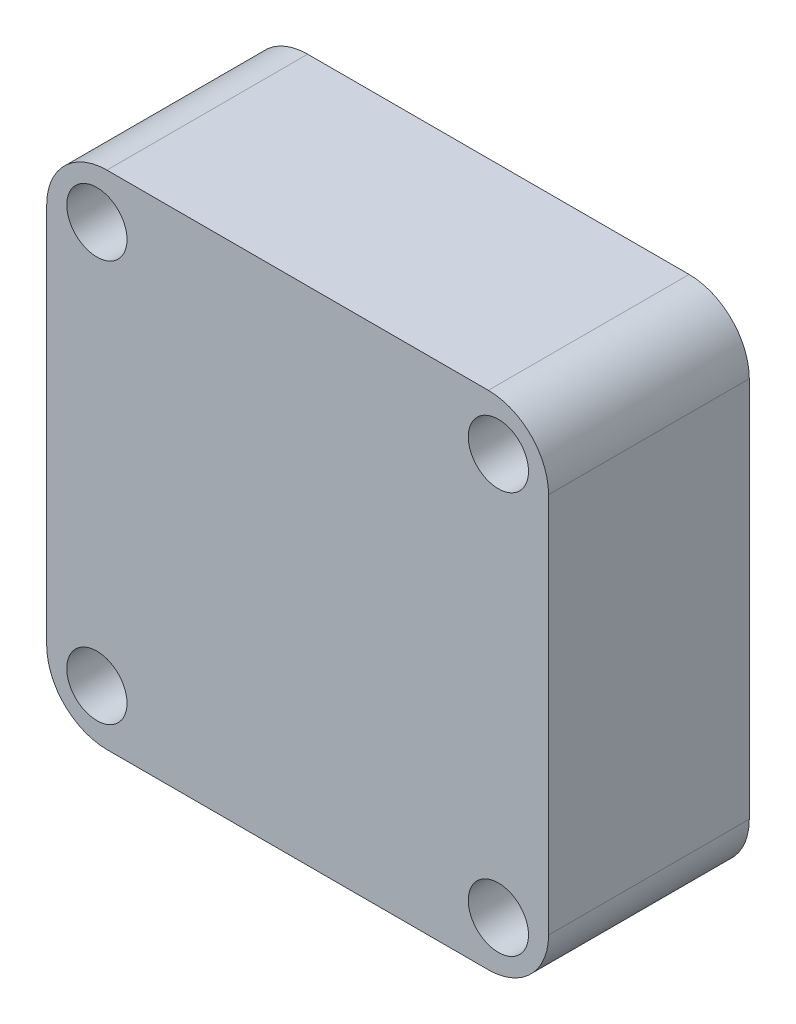
ISO-10303-21;
HEADER;
FILE_DESCRIPTION(('STEP AP214'),'2;1');
FILE_NAME('part.step','',(''),(''),'','','');
FILE_SCHEMA(('AUTOMOTIVE_DESIGN { 1 0 10303 214 1 1 1 1 }'));
ENDSEC;
DATA;
#1=APPLICATION_CONTEXT('core data for automotive mechanical design processes');
#2=APPLICATION_PROTOCOL_DEFINITION('international standard','automotive_design',2000,#1);
#3=PRODUCT_CONTEXT('',#1,'mechanical');
#4=PRODUCT('Part','Part','',(#3));
#5=PRODUCT_RELATED_PRODUCT_CATEGORY('part','',(#4));
#6=PRODUCT_DEFINITION_FORMATION('','',#4);
#7=PRODUCT_DEFINITION_CONTEXT('part definition',#1,'design');
#8=PRODUCT_DEFINITION('design','',#6,#7);
#9=PRODUCT_DEFINITION_SHAPE('','',#8);
#10=(LENGTH_UNIT() NAMED_UNIT(*) SI_UNIT(.MILLI.,.METRE.));
#11=(NAMED_UNIT(*) PLANE_ANGLE_UNIT() SI_UNIT($,.RADIAN.));
#12=(NAMED_UNIT(*) SI_UNIT($,.STERADIAN.) SOLID_ANGLE_UNIT());
#13=UNCERTAINTY_MEASURE_WITH_UNIT(LENGTH_MEASURE(1.E-05),#10,'distance_accuracy_value','');
#14=(GEOMETRIC_REPRESENTATION_CONTEXT(3) GLOBAL_UNCERTAINTY_ASSIGNED_CONTEXT((#13)) GLOBAL_UNIT_ASSIGNED_CONTEXT((#10,
#11,#12)) REPRESENTATION_CONTEXT('',''));
#15=CARTESIAN_POINT('',(0.,0.,0.));
#16=DIRECTION('',(0.,0.,1.));
#17=DIRECTION('',(1.,0.,0.));
#18=AXIS2_PLACEMENT_3D('',#15,#16,#17);
#19=CARTESIAN_POINT('',(-9.50000000000001,-129.5,-10.));
#20=DIRECTION('',(0.,0.,1.));
#21=DIRECTION('',(1.,0.,0.));
#22=AXIS2_PLACEMENT_3D('',#19,#20,#21);
#23=CYLINDRICAL_SURFACE('',#22,3.);
#24=CARTESIAN_POINT('',(-9.50000000000001,-129.5,0.));
#25=DIRECTION('',(0.,0.,1.));
#26=DIRECTION('',(1.,0.,0.));
#27=AXIS2_PLACEMENT_3D('',#24,#25,#26);
#28=CIRCLE('',#27,3.);
#29=CARTESIAN_POINT('',(-12.5,-129.5,0.));
#30=VERTEX_POINT('',#29);
#31=CARTESIAN_POINT('',(-9.50000000000001,-132.5,0.));
#32=VERTEX_POINT('',#31);
#33=EDGE_CURVE('E166',#30,#32,#28,.T.);
#34=ORIENTED_EDGE('',*,*,#33,.F.);
#35=DIRECTION('',(0.,0.,1.));
#36=VECTOR('',#35,1.);
#37=CARTESIAN_POINT('',(-12.5,-129.5,-10.));
#38=LINE('',#37,#36);
#39=CARTESIAN_POINT('',(-12.5,-129.5,-10.));
#40=VERTEX_POINT('',#39);
#41=EDGE_CURVE('E11',#40,#30,#38,.T.);
#42=ORIENTED_EDGE('',*,*,#41,.F.);
#43=CARTESIAN_POINT('',(-9.50000000000001,-129.5,-10.));
#44=DIRECTION('',(0.,0.,1.));
#45=DIRECTION('',(1.,0.,0.));
#46=AXIS2_PLACEMENT_3D('',#43,#44,#45);
#47=CIRCLE('',#46,3.);
#48=CARTESIAN_POINT('',(-9.50000000000001,-132.5,-10.));
#49=VERTEX_POINT('',#48);
#50=EDGE_CURVE('E194',#40,#49,#47,.T.);
#51=ORIENTED_EDGE('',*,*,#50,.T.);
#52=DIRECTION('',(0.,0.,1.));
#53=VECTOR('',#52,1.);
#54=CARTESIAN_POINT('',(-9.50000000000001,-132.5,-10.));
#55=LINE('',#54,#53);
#56=EDGE_CURVE('E48',#49,#32,#55,.T.);
#57=ORIENTED_EDGE('',*,*,#56,.T.);
#58=EDGE_LOOP('',(#34,#42,#51,#57));
#59=FACE_BOUND('',#58,.T.);
#60=ADVANCED_FACE('F45',(#59),#23,.T.);
#61=CARTESIAN_POINT('',(-12.5,-110.5,-10.));
#62=DIRECTION('',(-1.,0.,0.));
#63=DIRECTION('',(0.,0.,1.));
#64=AXIS2_PLACEMENT_3D('',#61,#62,#63);
#65=PLANE('',#64);
#66=DIRECTION('',(0.,-1.,0.));
#67=VECTOR('',#66,1.);
#68=CARTESIAN_POINT('',(-12.5,-110.5,0.));
#69=LINE('',#68,#67);
#70=CARTESIAN_POINT('',(-12.5,-110.5,0.));
#71=VERTEX_POINT('',#70);
#72=EDGE_CURVE('E191',#71,#30,#69,.T.);
#73=ORIENTED_EDGE('',*,*,#72,.F.);
#74=DIRECTION('',(0.,0.,1.));
#75=VECTOR('',#74,1.);
#76=CARTESIAN_POINT('',(-12.5,-110.5,-10.));
#77=LINE('',#76,#75);
#78=CARTESIAN_POINT('',(-12.5,-110.5,-10.));
#79=VERTEX_POINT('',#78);
#80=EDGE_CURVE('E55',#79,#71,#77,.T.);
#81=ORIENTED_EDGE('',*,*,#80,.F.);
#82=DIRECTION('',(0.,-1.,0.));
#83=VECTOR('',#82,1.);
#84=CARTESIAN_POINT('',(-12.5,-110.5,-10.));
#85=LINE('',#84,#83);
#86=EDGE_CURVE('E150',#79,#40,#85,.T.);
#87=ORIENTED_EDGE('',*,*,#86,.T.);
#88=ORIENTED_EDGE('',*,*,#41,.T.);
#89=EDGE_LOOP('',(#73,#81,#87,#88));
#90=FACE_BOUND('',#89,.T.);
#91=ADVANCED_FACE('F213',(#90),#65,.T.);
#92=CARTESIAN_POINT('',(-9.50000000000001,-110.5,-10.));
#93=DIRECTION('',(0.,0.,1.));
#94=DIRECTION('',(1.,0.,0.));
#95=AXIS2_PLACEMENT_3D('',#92,#93,#94);
#96=CYLINDRICAL_SURFACE('',#95,3.);
#97=CARTESIAN_POINT('',(-9.50000000000001,-110.5,0.));
#98=DIRECTION('',(0.,0.,1.));
#99=DIRECTION('',(1.,0.,0.));
#100=AXIS2_PLACEMENT_3D('',#97,#98,#99);
#101=CIRCLE('',#100,3.);
#102=CARTESIAN_POINT('',(-9.50000000000001,-107.5,0.));
#103=VERTEX_POINT('',#102);
#104=EDGE_CURVE('E136',#103,#71,#101,.T.);
#105=ORIENTED_EDGE('',*,*,#104,.F.);
#106=DIRECTION('',(0.,0.,1.));
#107=VECTOR('',#106,1.);
#108=CARTESIAN_POINT('',(-9.50000000000001,-107.5,-10.));
#109=LINE('',#108,#107);
#110=CARTESIAN_POINT('',(-9.50000000000001,-107.5,-10.));
#111=VERTEX_POINT('',#110);
#112=EDGE_CURVE('E131',#111,#103,#109,.T.);
#113=ORIENTED_EDGE('',*,*,#112,.F.);
#114=CARTESIAN_POINT('',(-9.50000000000001,-110.5,-10.));
#115=DIRECTION('',(0.,0.,1.));
#116=DIRECTION('',(1.,0.,0.));
#117=AXIS2_PLACEMENT_3D('',#114,#115,#116);
#118=CIRCLE('',#117,3.);
#119=EDGE_CURVE('E134',#111,#79,#118,.T.);
#120=ORIENTED_EDGE('',*,*,#119,.T.);
#121=ORIENTED_EDGE('',*,*,#80,.T.);
#122=EDGE_LOOP('',(#105,#113,#120,#121));
#123=FACE_BOUND('',#122,.T.);
#124=ADVANCED_FACE('F133',(#123),#96,.T.);
#125=CARTESIAN_POINT('',(-9.50000000000001,-107.5,-10.));
#126=DIRECTION('',(0.,1.,0.));
#127=DIRECTION('',(0.,0.,1.));
#128=AXIS2_PLACEMENT_3D('',#125,#126,#127);
#129=PLANE('',#128);
#130=DIRECTION('',(-1.,0.,0.));
#131=VECTOR('',#130,1.);
#132=CARTESIAN_POINT('',(-9.50000000000001,-107.5,0.));
#133=LINE('',#132,#131);
#134=CARTESIAN_POINT('',(9.49999999999998,-107.5,0.));
#135=VERTEX_POINT('',#134);
#136=EDGE_CURVE('E187',#135,#103,#133,.T.);
#137=ORIENTED_EDGE('',*,*,#136,.F.);
#138=DIRECTION('',(0.,0.,1.));
#139=VECTOR('',#138,1.);
#140=CARTESIAN_POINT('',(9.49999999999998,-107.5,-10.));
#141=LINE('',#140,#139);
#142=CARTESIAN_POINT('',(9.49999999999998,-107.5,-10.));
#143=VERTEX_POINT('',#142);
#144=EDGE_CURVE('E142',#143,#135,#141,.T.);
#145=ORIENTED_EDGE('',*,*,#144,.F.);
#146=DIRECTION('',(-1.,0.,0.));
#147=VECTOR('',#146,1.);
#148=CARTESIAN_POINT('',(-9.50000000000001,-107.5,-10.));
#149=LINE('',#148,#147);
#150=EDGE_CURVE('E148',#143,#111,#149,.T.);
#151=ORIENTED_EDGE('',*,*,#150,.T.);
#152=ORIENTED_EDGE('',*,*,#112,.T.);
#153=EDGE_LOOP('',(#137,#145,#151,#152));
#154=FACE_BOUND('',#153,.T.);
#155=ADVANCED_FACE('F153',(#154),#129,.T.);
#156=CARTESIAN_POINT('',(9.49999999999998,-110.5,-10.));
#157=DIRECTION('',(0.,0.,1.));
#158=DIRECTION('',(1.,0.,0.));
#159=AXIS2_PLACEMENT_3D('',#156,#157,#158);
#160=CYLINDRICAL_SURFACE('',#159,3.);
#161=CARTESIAN_POINT('',(9.49999999999998,-110.5,0.));
#162=DIRECTION('',(0.,0.,1.));
#163=DIRECTION('',(-1.,0.,0.));
#164=AXIS2_PLACEMENT_3D('',#161,#162,#163);
#165=CIRCLE('',#164,3.);
#166=CARTESIAN_POINT('',(12.5,-110.5,0.));
#167=VERTEX_POINT('',#166);
#168=EDGE_CURVE('E183',#167,#135,#165,.T.);
#169=ORIENTED_EDGE('',*,*,#168,.F.);
#170=DIRECTION('',(0.,0.,1.));
#171=VECTOR('',#170,1.);
#172=CARTESIAN_POINT('',(12.5,-110.5,-10.));
#173=LINE('',#172,#171);
#174=CARTESIAN_POINT('',(12.5,-110.5,-10.));
#175=VERTEX_POINT('',#174);
#176=EDGE_CURVE('E199',#175,#167,#173,.T.);
#177=ORIENTED_EDGE('',*,*,#176,.F.);
#178=CARTESIAN_POINT('',(9.49999999999998,-110.5,-10.));
#179=DIRECTION('',(0.,0.,1.));
#180=DIRECTION('',(-1.,0.,0.));
#181=AXIS2_PLACEMENT_3D('',#178,#179,#180);
#182=CIRCLE('',#181,3.);
#183=EDGE_CURVE('E155',#175,#143,#182,.T.);
#184=ORIENTED_EDGE('',*,*,#183,.T.);
#185=ORIENTED_EDGE('',*,*,#144,.T.);
#186=EDGE_LOOP('',(#169,#177,#184,#185));
#187=FACE_BOUND('',#186,.T.);
#188=ADVANCED_FACE('F226',(#187),#160,.T.);
#189=CARTESIAN_POINT('',(12.5,-110.5,-10.));
#190=DIRECTION('',(1.,0.,0.));
#191=DIRECTION('',(0.,0.,-1.));
#192=AXIS2_PLACEMENT_3D('',#189,#190,#191);
#193=PLANE('',#192);
#194=DIRECTION('',(0.,1.,0.));
#195=VECTOR('',#194,1.);
#196=CARTESIAN_POINT('',(12.5,-110.5,0.));
#197=LINE('',#196,#195);
#198=CARTESIAN_POINT('',(12.5,-129.5,0.));
#199=VERTEX_POINT('',#198);
#200=EDGE_CURVE('E179',#199,#167,#197,.T.);
#201=ORIENTED_EDGE('',*,*,#200,.F.);
#202=DIRECTION('',(0.,0.,1.));
#203=VECTOR('',#202,1.);
#204=CARTESIAN_POINT('',(12.5,-129.5,-10.));
#205=LINE('',#204,#203);
#206=CARTESIAN_POINT('',(12.5,-129.5,-10.));
#207=VERTEX_POINT('',#206);
#208=EDGE_CURVE('E202',#207,#199,#205,.T.);
#209=ORIENTED_EDGE('',*,*,#208,.F.);
#210=DIRECTION('',(0.,1.,0.));
#211=VECTOR('',#210,1.);
#212=CARTESIAN_POINT('',(12.5,-110.5,-10.));
#213=LINE('',#212,#211);
#214=EDGE_CURVE('E160',#207,#175,#213,.T.);
#215=ORIENTED_EDGE('',*,*,#214,.T.);
#216=ORIENTED_EDGE('',*,*,#176,.T.);
#217=EDGE_LOOP('',(#201,#209,#215,#216));
#218=FACE_BOUND('',#217,.T.);
#219=ADVANCED_FACE('F229',(#218),#193,.T.);
#220=CARTESIAN_POINT('',(9.49999999999998,-129.5,-10.));
#221=DIRECTION('',(0.,0.,1.));
#222=DIRECTION('',(1.,0.,0.));
#223=AXIS2_PLACEMENT_3D('',#220,#221,#222);
#224=CYLINDRICAL_SURFACE('',#223,3.);
#225=CARTESIAN_POINT('',(9.49999999999998,-129.5,0.));
#226=DIRECTION('',(0.,0.,1.));
#227=DIRECTION('',(1.,0.,0.));
#228=AXIS2_PLACEMENT_3D('',#225,#226,#227);
#229=CIRCLE('',#228,3.);
#230=CARTESIAN_POINT('',(9.49999999999998,-132.5,0.));
#231=VERTEX_POINT('',#230);
#232=EDGE_CURVE('E175',#231,#199,#229,.T.);
#233=ORIENTED_EDGE('',*,*,#232,.F.);
#234=DIRECTION('',(0.,0.,1.));
#235=VECTOR('',#234,1.);
#236=CARTESIAN_POINT('',(9.49999999999998,-132.5,-10.));
#237=LINE('',#236,#235);
#238=CARTESIAN_POINT('',(9.49999999999998,-132.5,-10.));
#239=VERTEX_POINT('',#238);
#240=EDGE_CURVE('E204',#239,#231,#237,.T.);
#241=ORIENTED_EDGE('',*,*,#240,.F.);
#242=CARTESIAN_POINT('',(9.49999999999998,-129.5,-10.));
#243=DIRECTION('',(0.,0.,1.));
#244=DIRECTION('',(1.,0.,0.));
#245=AXIS2_PLACEMENT_3D('',#242,#243,#244);
#246=CIRCLE('',#245,3.);
#247=EDGE_CURVE('E304',#239,#207,#246,.T.);
#248=ORIENTED_EDGE('',*,*,#247,.T.);
#249=ORIENTED_EDGE('',*,*,#208,.T.);
#250=EDGE_LOOP('',(#233,#241,#248,#249));
#251=FACE_BOUND('',#250,.T.);
#252=ADVANCED_FACE('F233',(#251),#224,.T.);
#253=CARTESIAN_POINT('',(-9.50000000000001,-132.5,-10.));
#254=DIRECTION('',(0.,-1.,0.));
#255=DIRECTION('',(0.,0.,-1.));
#256=AXIS2_PLACEMENT_3D('',#253,#254,#255);
#257=PLANE('',#256);
#258=DIRECTION('',(1.,0.,0.));
#259=VECTOR('',#258,1.);
#260=CARTESIAN_POINT('',(-9.50000000000001,-132.5,0.));
#261=LINE('',#260,#259);
#262=EDGE_CURVE('E170',#32,#231,#261,.T.);
#263=ORIENTED_EDGE('',*,*,#262,.F.);
#264=ORIENTED_EDGE('',*,*,#56,.F.);
#265=DIRECTION('',(1.,0.,0.));
#266=VECTOR('',#265,1.);
#267=CARTESIAN_POINT('',(-9.50000000000001,-132.5,-10.));
#268=LINE('',#267,#266);
#269=EDGE_CURVE('E302',#49,#239,#268,.T.);
#270=ORIENTED_EDGE('',*,*,#269,.T.);
#271=ORIENTED_EDGE('',*,*,#240,.T.);
#272=EDGE_LOOP('',(#263,#264,#270,#271));
#273=FACE_BOUND('',#272,.T.);
#274=ADVANCED_FACE('F210',(#273),#257,.T.);
#275=CARTESIAN_POINT('',(-9.50000000000001,-129.5,-10.));
#276=DIRECTION('',(0.,0.,1.));
#277=DIRECTION('',(1.,0.,0.));
#278=AXIS2_PLACEMENT_3D('',#275,#276,#277);
#279=PLANE('',#278);
#280=CARTESIAN_POINT('',(-10.,-130.,-10.));
#281=DIRECTION('',(0.,0.,1.));
#282=DIRECTION('',(1.,0.,0.));
#283=AXIS2_PLACEMENT_3D('',#280,#281,#282);
#284=CIRCLE('',#283,1.5);
#285=CARTESIAN_POINT('',(-8.50000000000001,-130.,-10.));
#286=VERTEX_POINT('',#285);
#287=EDGE_CURVE('E268',#286,#286,#284,.T.);
#288=ORIENTED_EDGE('',*,*,#287,.T.);
#289=EDGE_LOOP('',(#288));
#290=FACE_BOUND('',#289,.T.);
#291=CARTESIAN_POINT('',(-10.,-110.,-10.));
#292=DIRECTION('',(0.,0.,1.));
#293=DIRECTION('',(1.,0.,0.));
#294=AXIS2_PLACEMENT_3D('',#291,#292,#293);
#295=CIRCLE('',#294,1.5);
#296=CARTESIAN_POINT('',(-8.50000000000001,-110.,-10.));
#297=VERTEX_POINT('',#296);
#298=EDGE_CURVE('E278',#297,#297,#295,.T.);
#299=ORIENTED_EDGE('',*,*,#298,.T.);
#300=EDGE_LOOP('',(#299));
#301=FACE_BOUND('',#300,.T.);
#302=CARTESIAN_POINT('',(10.,-110.,-10.));
#303=DIRECTION('',(0.,0.,1.));
#304=DIRECTION('',(1.,0.,0.));
#305=AXIS2_PLACEMENT_3D('',#302,#303,#304);
#306=CIRCLE('',#305,1.5);
#307=CARTESIAN_POINT('',(11.5,-110.,-10.));
#308=VERTEX_POINT('',#307);
#309=EDGE_CURVE('E286',#308,#308,#306,.T.);
#310=ORIENTED_EDGE('',*,*,#309,.T.);
#311=EDGE_LOOP('',(#310));
#312=FACE_BOUND('',#311,.T.);
#313=CARTESIAN_POINT('',(10.,-130.,-10.));
#314=DIRECTION('',(0.,0.,1.));
#315=DIRECTION('',(1.,0.,0.));
#316=AXIS2_PLACEMENT_3D('',#313,#314,#315);
#317=CIRCLE('',#316,1.5);
#318=CARTESIAN_POINT('',(11.5,-130.,-10.));
#319=VERTEX_POINT('',#318);
#320=EDGE_CURVE('E171',#319,#319,#317,.T.);
#321=ORIENTED_EDGE('',*,*,#320,.T.);
#322=EDGE_LOOP('',(#321));
#323=FACE_BOUND('',#322,.T.);
#324=ORIENTED_EDGE('',*,*,#50,.F.);
#325=ORIENTED_EDGE('',*,*,#86,.F.);
#326=ORIENTED_EDGE('',*,*,#119,.F.);
#327=ORIENTED_EDGE('',*,*,#150,.F.);
#328=ORIENTED_EDGE('',*,*,#183,.F.);
#329=ORIENTED_EDGE('',*,*,#214,.F.);
#330=ORIENTED_EDGE('',*,*,#247,.F.);
#331=ORIENTED_EDGE('',*,*,#269,.F.);
#332=EDGE_LOOP('',(#324,#325,#326,#327,#328,#329,#330,#331));
#333=FACE_BOUND('',#332,.T.);
#334=ADVANCED_FACE('F146',(#290,#301,#312,#323,#333),#279,.F.);
#335=CARTESIAN_POINT('',(-9.50000000000001,-129.5,0.));
#336=DIRECTION('',(0.,0.,1.));
#337=DIRECTION('',(1.,0.,0.));
#338=AXIS2_PLACEMENT_3D('',#335,#336,#337);
#339=PLANE('',#338);
#340=CARTESIAN_POINT('',(-10.,-130.,0.));
#341=DIRECTION('',(0.,0.,1.));
#342=DIRECTION('',(1.,0.,0.));
#343=AXIS2_PLACEMENT_3D('',#340,#341,#342);
#344=CIRCLE('',#343,1.5);
#345=CARTESIAN_POINT('',(-8.50000000000001,-130.,0.));
#346=VERTEX_POINT('',#345);
#347=EDGE_CURVE('E271',#346,#346,#344,.T.);
#348=ORIENTED_EDGE('',*,*,#347,.F.);
#349=EDGE_LOOP('',(#348));
#350=FACE_BOUND('',#349,.T.);
#351=CARTESIAN_POINT('',(-10.,-110.,0.));
#352=DIRECTION('',(0.,0.,1.));
#353=DIRECTION('',(1.,0.,0.));
#354=AXIS2_PLACEMENT_3D('',#351,#352,#353);
#355=CIRCLE('',#354,1.5);
#356=CARTESIAN_POINT('',(-8.50000000000001,-110.,0.));
#357=VERTEX_POINT('',#356);
#358=EDGE_CURVE('E275',#357,#357,#355,.T.);
#359=ORIENTED_EDGE('',*,*,#358,.F.);
#360=EDGE_LOOP('',(#359));
#361=FACE_BOUND('',#360,.T.);
#362=CARTESIAN_POINT('',(10.,-110.,0.));
#363=DIRECTION('',(0.,0.,1.));
#364=DIRECTION('',(1.,0.,0.));
#365=AXIS2_PLACEMENT_3D('',#362,#363,#364);
#366=CIRCLE('',#365,1.5);
#367=CARTESIAN_POINT('',(11.5,-110.,0.));
#368=VERTEX_POINT('',#367);
#369=EDGE_CURVE('E282',#368,#368,#366,.T.);
#370=ORIENTED_EDGE('',*,*,#369,.F.);
#371=EDGE_LOOP('',(#370));
#372=FACE_BOUND('',#371,.T.);
#373=CARTESIAN_POINT('',(10.,-130.,0.));
#374=DIRECTION('',(0.,0.,1.));
#375=DIRECTION('',(1.,0.,0.));
#376=AXIS2_PLACEMENT_3D('',#373,#374,#375);
#377=CIRCLE('',#376,1.5);
#378=CARTESIAN_POINT('',(11.5,-130.,0.));
#379=VERTEX_POINT('',#378);
#380=EDGE_CURVE('E290',#379,#379,#377,.T.);
#381=ORIENTED_EDGE('',*,*,#380,.F.);
#382=EDGE_LOOP('',(#381));
#383=FACE_BOUND('',#382,.T.);
#384=ORIENTED_EDGE('',*,*,#33,.T.);
#385=ORIENTED_EDGE('',*,*,#262,.T.);
#386=ORIENTED_EDGE('',*,*,#232,.T.);
#387=ORIENTED_EDGE('',*,*,#200,.T.);
#388=ORIENTED_EDGE('',*,*,#168,.T.);
#389=ORIENTED_EDGE('',*,*,#136,.T.);
#390=ORIENTED_EDGE('',*,*,#104,.T.);
#391=ORIENTED_EDGE('',*,*,#72,.T.);
#392=EDGE_LOOP('',(#384,#385,#386,#387,#388,#389,#390,#391));
#393=FACE_BOUND('',#392,.T.);
#394=ADVANCED_FACE('F212',(#350,#361,#372,#383,#393),#339,.T.);
#395=CARTESIAN_POINT('',(10.,-130.,-10.));
#396=DIRECTION('',(0.,0.,1.));
#397=DIRECTION('',(1.,0.,0.));
#398=AXIS2_PLACEMENT_3D('',#395,#396,#397);
#399=CYLINDRICAL_SURFACE('',#398,1.5);
#400=ORIENTED_EDGE('',*,*,#320,.F.);
#401=EDGE_LOOP('',(#400));
#402=FACE_BOUND('',#401,.T.);
#403=ORIENTED_EDGE('',*,*,#380,.T.);
#404=EDGE_LOOP('',(#403));
#405=FACE_BOUND('',#404,.T.);
#406=ADVANCED_FACE('F245',(#402,#405),#399,.F.);
#407=CARTESIAN_POINT('',(10.,-110.,-10.));
#408=DIRECTION('',(0.,0.,1.));
#409=DIRECTION('',(1.,0.,0.));
#410=AXIS2_PLACEMENT_3D('',#407,#408,#409);
#411=CYLINDRICAL_SURFACE('',#410,1.5);
#412=ORIENTED_EDGE('',*,*,#309,.F.);
#413=EDGE_LOOP('',(#412));
#414=FACE_BOUND('',#413,.T.);
#415=ORIENTED_EDGE('',*,*,#369,.T.);
#416=EDGE_LOOP('',(#415));
#417=FACE_BOUND('',#416,.T.);
#418=ADVANCED_FACE('F252',(#414,#417),#411,.F.);
#419=CARTESIAN_POINT('',(-10.,-110.,-10.));
#420=DIRECTION('',(0.,0.,1.));
#421=DIRECTION('',(1.,0.,0.));
#422=AXIS2_PLACEMENT_3D('',#419,#420,#421);
#423=CYLINDRICAL_SURFACE('',#422,1.5);
#424=ORIENTED_EDGE('',*,*,#298,.F.);
#425=EDGE_LOOP('',(#424));
#426=FACE_BOUND('',#425,.T.);
#427=ORIENTED_EDGE('',*,*,#358,.T.);
#428=EDGE_LOOP('',(#427));
#429=FACE_BOUND('',#428,.T.);
#430=ADVANCED_FACE('F256',(#426,#429),#423,.F.);
#431=CARTESIAN_POINT('',(-10.,-130.,-10.));
#432=DIRECTION('',(0.,0.,1.));
#433=DIRECTION('',(1.,0.,0.));
#434=AXIS2_PLACEMENT_3D('',#431,#432,#433);
#435=CYLINDRICAL_SURFACE('',#434,1.5);
#436=ORIENTED_EDGE('',*,*,#287,.F.);
#437=EDGE_LOOP('',(#436));
#438=FACE_BOUND('',#437,.T.);
#439=ORIENTED_EDGE('',*,*,#347,.T.);
#440=EDGE_LOOP('',(#439));
#441=FACE_BOUND('',#440,.T.);
#442=ADVANCED_FACE('F260',(#438,#441),#435,.F.);
#443=CLOSED_SHELL('',(#60,#91,#124,#155,#188,#219,#252,#274,#334,#394,#406,#418,#430,#442));
#444=MANIFOLD_SOLID_BREP('B2',#443);
#445=ADVANCED_BREP_SHAPE_REPRESENTATION('',(#18,#444),#14);
#446=SHAPE_DEFINITION_REPRESENTATION(#9,#445);
ENDSEC;
END-ISO-10303-21;
